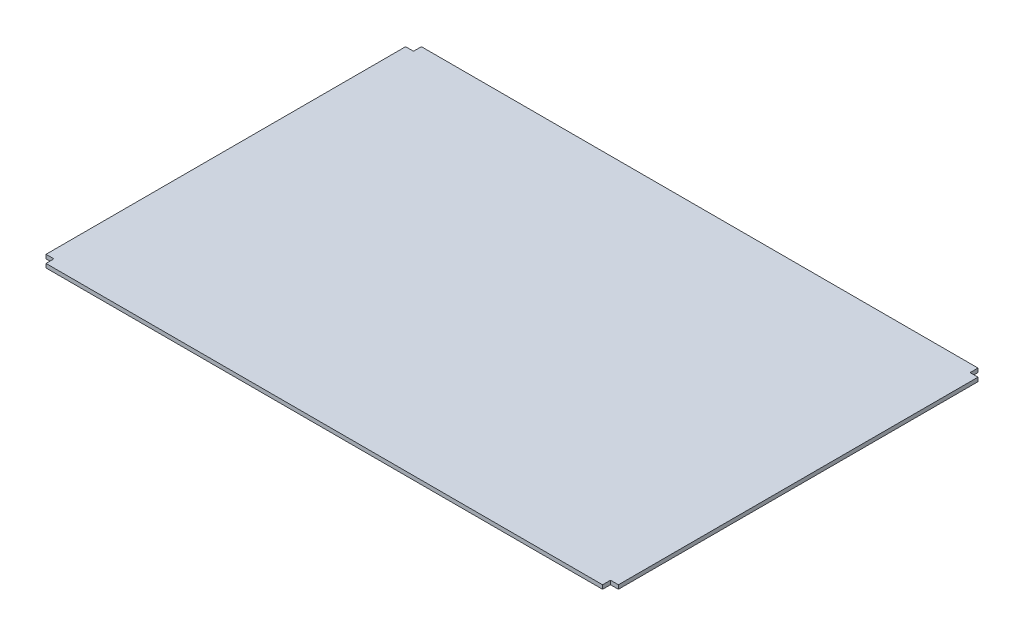
ISO-10303-21;
HEADER;
FILE_DESCRIPTION(('STEP AP214'),'2;1');
FILE_NAME('part.step','',(''),(''),'','','');
FILE_SCHEMA(('AUTOMOTIVE_DESIGN { 1 0 10303 214 1 1 1 1 }'));
ENDSEC;
DATA;
#1=APPLICATION_CONTEXT('core data for automotive mechanical design processes');
#2=APPLICATION_PROTOCOL_DEFINITION('international standard','automotive_design',2000,#1);
#3=PRODUCT_CONTEXT('',#1,'mechanical');
#4=PRODUCT('Part','Part','',(#3));
#5=PRODUCT_RELATED_PRODUCT_CATEGORY('part','',(#4));
#6=PRODUCT_DEFINITION_FORMATION('','',#4);
#7=PRODUCT_DEFINITION_CONTEXT('part definition',#1,'design');
#8=PRODUCT_DEFINITION('design','',#6,#7);
#9=PRODUCT_DEFINITION_SHAPE('','',#8);
#10=(LENGTH_UNIT() NAMED_UNIT(*) SI_UNIT(.MILLI.,.METRE.));
#11=(NAMED_UNIT(*) PLANE_ANGLE_UNIT() SI_UNIT($,.RADIAN.));
#12=(NAMED_UNIT(*) SI_UNIT($,.STERADIAN.) SOLID_ANGLE_UNIT());
#13=UNCERTAINTY_MEASURE_WITH_UNIT(LENGTH_MEASURE(1.E-05),#10,'distance_accuracy_value','');
#14=(GEOMETRIC_REPRESENTATION_CONTEXT(3) GLOBAL_UNCERTAINTY_ASSIGNED_CONTEXT((#13)) GLOBAL_UNIT_ASSIGNED_CONTEXT((#10,
#11,#12)) REPRESENTATION_CONTEXT('',''));
#15=CARTESIAN_POINT('',(0.,0.,0.));
#16=DIRECTION('',(0.,0.,1.));
#17=DIRECTION('',(1.,0.,0.));
#18=AXIS2_PLACEMENT_3D('',#15,#16,#17);
#19=CARTESIAN_POINT('',(1388.5,20.,910.));
#20=DIRECTION('',(-1.,0.,0.));
#21=DIRECTION('',(0.,0.,1.));
#22=AXIS2_PLACEMENT_3D('',#19,#20,#21);
#23=PLANE('',#22);
#24=DIRECTION('',(0.,0.,-1.));
#25=VECTOR('',#24,1.);
#26=CARTESIAN_POINT('',(1388.5,0.,910.));
#27=LINE('',#26,#25);
#28=CARTESIAN_POINT('',(1388.5,0.,910.));
#29=VERTEX_POINT('',#28);
#30=CARTESIAN_POINT('',(1388.5,0.,870.));
#31=VERTEX_POINT('',#30);
#32=EDGE_CURVE('E152',#29,#31,#27,.T.);
#33=ORIENTED_EDGE('',*,*,#32,.T.);
#34=DIRECTION('',(0.,-1.,0.));
#35=VECTOR('',#34,1.);
#36=CARTESIAN_POINT('',(1388.5,20.,870.));
#37=LINE('',#36,#35);
#38=CARTESIAN_POINT('',(1388.5,20.,870.));
#39=VERTEX_POINT('',#38);
#40=EDGE_CURVE('E11',#39,#31,#37,.T.);
#41=ORIENTED_EDGE('',*,*,#40,.F.);
#42=DIRECTION('',(0.,0.,-1.));
#43=VECTOR('',#42,1.);
#44=CARTESIAN_POINT('',(1388.5,20.,910.));
#45=LINE('',#44,#43);
#46=CARTESIAN_POINT('',(1388.5,20.,910.));
#47=VERTEX_POINT('',#46);
#48=EDGE_CURVE('E174',#47,#39,#45,.T.);
#49=ORIENTED_EDGE('',*,*,#48,.F.);
#50=DIRECTION('',(0.,-1.,0.));
#51=VECTOR('',#50,1.);
#52=CARTESIAN_POINT('',(1388.5,20.,910.));
#53=LINE('',#52,#51);
#54=EDGE_CURVE('E148',#47,#29,#53,.T.);
#55=ORIENTED_EDGE('',*,*,#54,.T.);
#56=EDGE_LOOP('',(#33,#41,#49,#55));
#57=FACE_BOUND('',#56,.T.);
#58=ADVANCED_FACE('F32',(#57),#23,.F.);
#59=CARTESIAN_POINT('',(1428.5,20.,870.));
#60=DIRECTION('',(0.,0.,-1.));
#61=DIRECTION('',(-1.,0.,0.));
#62=AXIS2_PLACEMENT_3D('',#59,#60,#61);
#63=PLANE('',#62);
#64=DIRECTION('',(1.,0.,0.));
#65=VECTOR('',#64,1.);
#66=CARTESIAN_POINT('',(1428.5,0.,870.));
#67=LINE('',#66,#65);
#68=CARTESIAN_POINT('',(1428.5,0.,870.));
#69=VERTEX_POINT('',#68);
#70=EDGE_CURVE('E155',#31,#69,#67,.T.);
#71=ORIENTED_EDGE('',*,*,#70,.T.);
#72=DIRECTION('',(0.,-1.,0.));
#73=VECTOR('',#72,1.);
#74=CARTESIAN_POINT('',(1428.5,20.,870.));
#75=LINE('',#74,#73);
#76=CARTESIAN_POINT('',(1428.5,20.,870.));
#77=VERTEX_POINT('',#76);
#78=EDGE_CURVE('E40',#77,#69,#75,.T.);
#79=ORIENTED_EDGE('',*,*,#78,.F.);
#80=DIRECTION('',(1.,0.,0.));
#81=VECTOR('',#80,1.);
#82=CARTESIAN_POINT('',(1428.5,20.,870.));
#83=LINE('',#82,#81);
#84=EDGE_CURVE('E103',#39,#77,#83,.T.);
#85=ORIENTED_EDGE('',*,*,#84,.F.);
#86=ORIENTED_EDGE('',*,*,#40,.T.);
#87=EDGE_LOOP('',(#71,#79,#85,#86));
#88=FACE_BOUND('',#87,.T.);
#89=ADVANCED_FACE('F252',(#88),#63,.F.);
#90=CARTESIAN_POINT('',(1428.5,20.,870.));
#91=DIRECTION('',(-1.,0.,0.));
#92=DIRECTION('',(0.,0.,1.));
#93=AXIS2_PLACEMENT_3D('',#90,#91,#92);
#94=PLANE('',#93);
#95=DIRECTION('',(0.,0.,-1.));
#96=VECTOR('',#95,1.);
#97=CARTESIAN_POINT('',(1428.5,0.,870.));
#98=LINE('',#97,#96);
#99=CARTESIAN_POINT('',(1428.5,0.,-950.));
#100=VERTEX_POINT('',#99);
#101=EDGE_CURVE('E157',#69,#100,#98,.T.);
#102=ORIENTED_EDGE('',*,*,#101,.T.);
#103=DIRECTION('',(0.,-1.,0.));
#104=VECTOR('',#103,1.);
#105=CARTESIAN_POINT('',(1428.5,20.,-950.));
#106=LINE('',#105,#104);
#107=CARTESIAN_POINT('',(1428.5,20.,-950.));
#108=VERTEX_POINT('',#107);
#109=EDGE_CURVE('E193',#108,#100,#106,.T.);
#110=ORIENTED_EDGE('',*,*,#109,.F.);
#111=DIRECTION('',(0.,0.,-1.));
#112=VECTOR('',#111,1.);
#113=CARTESIAN_POINT('',(1428.5,20.,870.));
#114=LINE('',#113,#112);
#115=EDGE_CURVE('E201',#77,#108,#114,.T.);
#116=ORIENTED_EDGE('',*,*,#115,.F.);
#117=ORIENTED_EDGE('',*,*,#78,.T.);
#118=EDGE_LOOP('',(#102,#110,#116,#117));
#119=FACE_BOUND('',#118,.T.);
#120=ADVANCED_FACE('F199',(#119),#94,.F.);
#121=CARTESIAN_POINT('',(1428.5,20.,-950.));
#122=DIRECTION('',(0.,0.,1.));
#123=DIRECTION('',(1.,0.,0.));
#124=AXIS2_PLACEMENT_3D('',#121,#122,#123);
#125=PLANE('',#124);
#126=DIRECTION('',(-1.,0.,0.));
#127=VECTOR('',#126,1.);
#128=CARTESIAN_POINT('',(1428.5,0.,-950.));
#129=LINE('',#128,#127);
#130=CARTESIAN_POINT('',(1388.5,0.,-950.));
#131=VERTEX_POINT('',#130);
#132=EDGE_CURVE('E159',#100,#131,#129,.T.);
#133=ORIENTED_EDGE('',*,*,#132,.T.);
#134=DIRECTION('',(0.,-1.,0.));
#135=VECTOR('',#134,1.);
#136=CARTESIAN_POINT('',(1388.5,20.,-950.));
#137=LINE('',#136,#135);
#138=CARTESIAN_POINT('',(1388.5,20.,-950.));
#139=VERTEX_POINT('',#138);
#140=EDGE_CURVE('E190',#139,#131,#137,.T.);
#141=ORIENTED_EDGE('',*,*,#140,.F.);
#142=DIRECTION('',(-1.,0.,0.));
#143=VECTOR('',#142,1.);
#144=CARTESIAN_POINT('',(1428.5,20.,-950.));
#145=LINE('',#144,#143);
#146=EDGE_CURVE('E219',#108,#139,#145,.T.);
#147=ORIENTED_EDGE('',*,*,#146,.F.);
#148=ORIENTED_EDGE('',*,*,#109,.T.);
#149=EDGE_LOOP('',(#133,#141,#147,#148));
#150=FACE_BOUND('',#149,.T.);
#151=ADVANCED_FACE('F210',(#150),#125,.F.);
#152=CARTESIAN_POINT('',(1388.5,20.,-989.999999999999));
#153=DIRECTION('',(-1.,0.,0.));
#154=DIRECTION('',(0.,0.,1.));
#155=AXIS2_PLACEMENT_3D('',#152,#153,#154);
#156=PLANE('',#155);
#157=DIRECTION('',(0.,0.,-1.));
#158=VECTOR('',#157,1.);
#159=CARTESIAN_POINT('',(1388.5,0.,-989.999999999999));
#160=LINE('',#159,#158);
#161=CARTESIAN_POINT('',(1388.5,0.,-989.999999999999));
#162=VERTEX_POINT('',#161);
#163=EDGE_CURVE('E161',#131,#162,#160,.T.);
#164=ORIENTED_EDGE('',*,*,#163,.T.);
#165=DIRECTION('',(0.,-1.,0.));
#166=VECTOR('',#165,1.);
#167=CARTESIAN_POINT('',(1388.5,20.,-989.999999999999));
#168=LINE('',#167,#166);
#169=CARTESIAN_POINT('',(1388.5,20.,-989.999999999999));
#170=VERTEX_POINT('',#169);
#171=EDGE_CURVE('E187',#170,#162,#168,.T.);
#172=ORIENTED_EDGE('',*,*,#171,.F.);
#173=DIRECTION('',(0.,0.,-1.));
#174=VECTOR('',#173,1.);
#175=CARTESIAN_POINT('',(1388.5,20.,-989.999999999999));
#176=LINE('',#175,#174);
#177=EDGE_CURVE('E216',#139,#170,#176,.T.);
#178=ORIENTED_EDGE('',*,*,#177,.F.);
#179=ORIENTED_EDGE('',*,*,#140,.T.);
#180=EDGE_LOOP('',(#164,#172,#178,#179));
#181=FACE_BOUND('',#180,.T.);
#182=ADVANCED_FACE('F214',(#181),#156,.F.);
#183=CARTESIAN_POINT('',(1388.5,20.,-989.999999999999));
#184=DIRECTION('',(0.,0.,1.));
#185=DIRECTION('',(1.,0.,0.));
#186=AXIS2_PLACEMENT_3D('',#183,#184,#185);
#187=PLANE('',#186);
#188=DIRECTION('',(-1.,0.,0.));
#189=VECTOR('',#188,1.);
#190=CARTESIAN_POINT('',(1388.5,0.,-989.999999999999));
#191=LINE('',#190,#189);
#192=CARTESIAN_POINT('',(-1428.5,0.,-989.999999999999));
#193=VERTEX_POINT('',#192);
#194=EDGE_CURVE('E163',#162,#193,#191,.T.);
#195=ORIENTED_EDGE('',*,*,#194,.T.);
#196=DIRECTION('',(0.,-1.,0.));
#197=VECTOR('',#196,1.);
#198=CARTESIAN_POINT('',(-1428.5,20.,-989.999999999999));
#199=LINE('',#198,#197);
#200=CARTESIAN_POINT('',(-1428.5,20.,-989.999999999999));
#201=VERTEX_POINT('',#200);
#202=EDGE_CURVE('E184',#201,#193,#199,.T.);
#203=ORIENTED_EDGE('',*,*,#202,.F.);
#204=DIRECTION('',(-1.,0.,0.));
#205=VECTOR('',#204,1.);
#206=CARTESIAN_POINT('',(1388.5,20.,-989.999999999999));
#207=LINE('',#206,#205);
#208=EDGE_CURVE('E218',#170,#201,#207,.T.);
#209=ORIENTED_EDGE('',*,*,#208,.F.);
#210=ORIENTED_EDGE('',*,*,#171,.T.);
#211=EDGE_LOOP('',(#195,#203,#209,#210));
#212=FACE_BOUND('',#211,.T.);
#213=ADVANCED_FACE('F265',(#212),#187,.F.);
#214=CARTESIAN_POINT('',(-1428.5,20.,-989.999999999999));
#215=DIRECTION('',(1.,0.,0.));
#216=DIRECTION('',(0.,0.,-1.));
#217=AXIS2_PLACEMENT_3D('',#214,#215,#216);
#218=PLANE('',#217);
#219=DIRECTION('',(0.,0.,1.));
#220=VECTOR('',#219,1.);
#221=CARTESIAN_POINT('',(-1428.5,0.,-989.999999999999));
#222=LINE('',#221,#220);
#223=CARTESIAN_POINT('',(-1428.5,0.,-949.999999999999));
#224=VERTEX_POINT('',#223);
#225=EDGE_CURVE('E165',#193,#224,#222,.T.);
#226=ORIENTED_EDGE('',*,*,#225,.T.);
#227=DIRECTION('',(0.,-1.,0.));
#228=VECTOR('',#227,1.);
#229=CARTESIAN_POINT('',(-1428.5,20.,-949.999999999999));
#230=LINE('',#229,#228);
#231=CARTESIAN_POINT('',(-1428.5,20.,-949.999999999999));
#232=VERTEX_POINT('',#231);
#233=EDGE_CURVE('E181',#232,#224,#230,.T.);
#234=ORIENTED_EDGE('',*,*,#233,.F.);
#235=DIRECTION('',(0.,0.,1.));
#236=VECTOR('',#235,1.);
#237=CARTESIAN_POINT('',(-1428.5,20.,-989.999999999999));
#238=LINE('',#237,#236);
#239=EDGE_CURVE('E221',#201,#232,#238,.T.);
#240=ORIENTED_EDGE('',*,*,#239,.F.);
#241=ORIENTED_EDGE('',*,*,#202,.T.);
#242=EDGE_LOOP('',(#226,#234,#240,#241));
#243=FACE_BOUND('',#242,.T.);
#244=ADVANCED_FACE('F268',(#243),#218,.F.);
#245=CARTESIAN_POINT('',(-1468.5,20.,-949.999999999999));
#246=DIRECTION('',(0.,0.,1.));
#247=DIRECTION('',(1.,0.,0.));
#248=AXIS2_PLACEMENT_3D('',#245,#246,#247);
#249=PLANE('',#248);
#250=DIRECTION('',(-1.,0.,0.));
#251=VECTOR('',#250,1.);
#252=CARTESIAN_POINT('',(-1468.5,0.,-949.999999999999));
#253=LINE('',#252,#251);
#254=CARTESIAN_POINT('',(-1468.5,0.,-949.999999999999));
#255=VERTEX_POINT('',#254);
#256=EDGE_CURVE('E167',#224,#255,#253,.T.);
#257=ORIENTED_EDGE('',*,*,#256,.T.);
#258=DIRECTION('',(0.,-1.,0.));
#259=VECTOR('',#258,1.);
#260=CARTESIAN_POINT('',(-1468.5,20.,-949.999999999999));
#261=LINE('',#260,#259);
#262=CARTESIAN_POINT('',(-1468.5,20.,-949.999999999999));
#263=VERTEX_POINT('',#262);
#264=EDGE_CURVE('E178',#263,#255,#261,.T.);
#265=ORIENTED_EDGE('',*,*,#264,.F.);
#266=DIRECTION('',(-1.,0.,0.));
#267=VECTOR('',#266,1.);
#268=CARTESIAN_POINT('',(-1468.5,20.,-949.999999999999));
#269=LINE('',#268,#267);
#270=EDGE_CURVE('E227',#232,#263,#269,.T.);
#271=ORIENTED_EDGE('',*,*,#270,.F.);
#272=ORIENTED_EDGE('',*,*,#233,.T.);
#273=EDGE_LOOP('',(#257,#265,#271,#272));
#274=FACE_BOUND('',#273,.T.);
#275=ADVANCED_FACE('F233',(#274),#249,.F.);
#276=CARTESIAN_POINT('',(-1468.5,20.,870.000000000001));
#277=DIRECTION('',(1.,0.,0.));
#278=DIRECTION('',(0.,0.,-1.));
#279=AXIS2_PLACEMENT_3D('',#276,#277,#278);
#280=PLANE('',#279);
#281=DIRECTION('',(0.,0.,1.));
#282=VECTOR('',#281,1.);
#283=CARTESIAN_POINT('',(-1468.5,0.,870.000000000001));
#284=LINE('',#283,#282);
#285=CARTESIAN_POINT('',(-1468.5,0.,870.000000000001));
#286=VERTEX_POINT('',#285);
#287=EDGE_CURVE('E169',#255,#286,#284,.T.);
#288=ORIENTED_EDGE('',*,*,#287,.T.);
#289=DIRECTION('',(0.,-1.,0.));
#290=VECTOR('',#289,1.);
#291=CARTESIAN_POINT('',(-1468.5,20.,870.000000000001));
#292=LINE('',#291,#290);
#293=CARTESIAN_POINT('',(-1468.5,20.,870.000000000001));
#294=VERTEX_POINT('',#293);
#295=EDGE_CURVE('E143',#294,#286,#292,.T.);
#296=ORIENTED_EDGE('',*,*,#295,.F.);
#297=DIRECTION('',(0.,0.,1.));
#298=VECTOR('',#297,1.);
#299=CARTESIAN_POINT('',(-1468.5,20.,870.000000000001));
#300=LINE('',#299,#298);
#301=EDGE_CURVE('E134',#263,#294,#300,.T.);
#302=ORIENTED_EDGE('',*,*,#301,.F.);
#303=ORIENTED_EDGE('',*,*,#264,.T.);
#304=EDGE_LOOP('',(#288,#296,#302,#303));
#305=FACE_BOUND('',#304,.T.);
#306=ADVANCED_FACE('F237',(#305),#280,.F.);
#307=CARTESIAN_POINT('',(-1468.5,20.,870.000000000001));
#308=DIRECTION('',(0.,0.,-1.));
#309=DIRECTION('',(-1.,0.,0.));
#310=AXIS2_PLACEMENT_3D('',#307,#308,#309);
#311=PLANE('',#310);
#312=DIRECTION('',(1.,0.,0.));
#313=VECTOR('',#312,1.);
#314=CARTESIAN_POINT('',(-1468.5,0.,870.000000000001));
#315=LINE('',#314,#313);
#316=CARTESIAN_POINT('',(-1428.5,0.,870.000000000001));
#317=VERTEX_POINT('',#316);
#318=EDGE_CURVE('E142',#286,#317,#315,.T.);
#319=ORIENTED_EDGE('',*,*,#318,.T.);
#320=DIRECTION('',(0.,-1.,0.));
#321=VECTOR('',#320,1.);
#322=CARTESIAN_POINT('',(-1428.5,20.,870.000000000001));
#323=LINE('',#322,#321);
#324=CARTESIAN_POINT('',(-1428.5,20.,870.000000000001));
#325=VERTEX_POINT('',#324);
#326=EDGE_CURVE('E139',#325,#317,#323,.T.);
#327=ORIENTED_EDGE('',*,*,#326,.F.);
#328=DIRECTION('',(1.,0.,0.));
#329=VECTOR('',#328,1.);
#330=CARTESIAN_POINT('',(-1468.5,20.,870.000000000001));
#331=LINE('',#330,#329);
#332=EDGE_CURVE('E128',#294,#325,#331,.T.);
#333=ORIENTED_EDGE('',*,*,#332,.F.);
#334=ORIENTED_EDGE('',*,*,#295,.T.);
#335=EDGE_LOOP('',(#319,#327,#333,#334));
#336=FACE_BOUND('',#335,.T.);
#337=ADVANCED_FACE('F140',(#336),#311,.F.);
#338=CARTESIAN_POINT('',(-1428.5,20.,910.));
#339=DIRECTION('',(1.,0.,0.));
#340=DIRECTION('',(0.,0.,-1.));
#341=AXIS2_PLACEMENT_3D('',#338,#339,#340);
#342=PLANE('',#341);
#343=DIRECTION('',(0.,0.,1.));
#344=VECTOR('',#343,1.);
#345=CARTESIAN_POINT('',(-1428.5,0.,910.));
#346=LINE('',#345,#344);
#347=CARTESIAN_POINT('',(-1428.5,0.,910.));
#348=VERTEX_POINT('',#347);
#349=EDGE_CURVE('E89',#317,#348,#346,.T.);
#350=ORIENTED_EDGE('',*,*,#349,.T.);
#351=DIRECTION('',(0.,-1.,0.));
#352=VECTOR('',#351,1.);
#353=CARTESIAN_POINT('',(-1428.5,20.,910.));
#354=LINE('',#353,#352);
#355=CARTESIAN_POINT('',(-1428.5,20.,910.));
#356=VERTEX_POINT('',#355);
#357=EDGE_CURVE('E144',#356,#348,#354,.T.);
#358=ORIENTED_EDGE('',*,*,#357,.F.);
#359=DIRECTION('',(0.,0.,1.));
#360=VECTOR('',#359,1.);
#361=CARTESIAN_POINT('',(-1428.5,20.,910.));
#362=LINE('',#361,#360);
#363=EDGE_CURVE('E132',#325,#356,#362,.T.);
#364=ORIENTED_EDGE('',*,*,#363,.F.);
#365=ORIENTED_EDGE('',*,*,#326,.T.);
#366=EDGE_LOOP('',(#350,#358,#364,#365));
#367=FACE_BOUND('',#366,.T.);
#368=ADVANCED_FACE('F146',(#367),#342,.F.);
#369=CARTESIAN_POINT('',(1388.5,20.,910.));
#370=DIRECTION('',(0.,0.,-1.));
#371=DIRECTION('',(-1.,0.,0.));
#372=AXIS2_PLACEMENT_3D('',#369,#370,#371);
#373=PLANE('',#372);
#374=DIRECTION('',(1.,0.,0.));
#375=VECTOR('',#374,1.);
#376=CARTESIAN_POINT('',(1388.5,0.,910.));
#377=LINE('',#376,#375);
#378=EDGE_CURVE('E95',#348,#29,#377,.T.);
#379=ORIENTED_EDGE('',*,*,#378,.T.);
#380=ORIENTED_EDGE('',*,*,#54,.F.);
#381=DIRECTION('',(1.,0.,0.));
#382=VECTOR('',#381,1.);
#383=CARTESIAN_POINT('',(1388.5,20.,910.));
#384=LINE('',#383,#382);
#385=EDGE_CURVE('E48',#356,#47,#384,.T.);
#386=ORIENTED_EDGE('',*,*,#385,.F.);
#387=ORIENTED_EDGE('',*,*,#357,.T.);
#388=EDGE_LOOP('',(#379,#380,#386,#387));
#389=FACE_BOUND('',#388,.T.);
#390=ADVANCED_FACE('F241',(#389),#373,.F.);
#391=CARTESIAN_POINT('',(0.,20.,0.));
#392=DIRECTION('',(0.,1.,0.));
#393=DIRECTION('',(0.,0.,1.));
#394=AXIS2_PLACEMENT_3D('',#391,#392,#393);
#395=PLANE('',#394);
#396=ORIENTED_EDGE('',*,*,#48,.T.);
#397=ORIENTED_EDGE('',*,*,#84,.T.);
#398=ORIENTED_EDGE('',*,*,#115,.T.);
#399=ORIENTED_EDGE('',*,*,#146,.T.);
#400=ORIENTED_EDGE('',*,*,#177,.T.);
#401=ORIENTED_EDGE('',*,*,#208,.T.);
#402=ORIENTED_EDGE('',*,*,#239,.T.);
#403=ORIENTED_EDGE('',*,*,#270,.T.);
#404=ORIENTED_EDGE('',*,*,#301,.T.);
#405=ORIENTED_EDGE('',*,*,#332,.T.);
#406=ORIENTED_EDGE('',*,*,#363,.T.);
#407=ORIENTED_EDGE('',*,*,#385,.T.);
#408=EDGE_LOOP('',(#396,#397,#398,#399,#400,#401,#402,#403,#404,#405,#406,#407));
#409=FACE_BOUND('',#408,.T.);
#410=ADVANCED_FACE('F130',(#409),#395,.T.);
#411=CARTESIAN_POINT('',(0.,0.,0.));
#412=DIRECTION('',(0.,1.,0.));
#413=DIRECTION('',(0.,0.,1.));
#414=AXIS2_PLACEMENT_3D('',#411,#412,#413);
#415=PLANE('',#414);
#416=ORIENTED_EDGE('',*,*,#32,.F.);
#417=ORIENTED_EDGE('',*,*,#378,.F.);
#418=ORIENTED_EDGE('',*,*,#349,.F.);
#419=ORIENTED_EDGE('',*,*,#318,.F.);
#420=ORIENTED_EDGE('',*,*,#287,.F.);
#421=ORIENTED_EDGE('',*,*,#256,.F.);
#422=ORIENTED_EDGE('',*,*,#225,.F.);
#423=ORIENTED_EDGE('',*,*,#194,.F.);
#424=ORIENTED_EDGE('',*,*,#163,.F.);
#425=ORIENTED_EDGE('',*,*,#132,.F.);
#426=ORIENTED_EDGE('',*,*,#101,.F.);
#427=ORIENTED_EDGE('',*,*,#70,.F.);
#428=EDGE_LOOP('',(#416,#417,#418,#419,#420,#421,#422,#423,#424,#425,#426,#427));
#429=FACE_BOUND('',#428,.T.);
#430=ADVANCED_FACE('F205',(#429),#415,.F.);
#431=CLOSED_SHELL('',(#58,#89,#120,#151,#182,#213,#244,#275,#306,#337,#368,#390,#410,#430));
#432=MANIFOLD_SOLID_BREP('B2',#431);
#433=ADVANCED_BREP_SHAPE_REPRESENTATION('',(#18,#432),#14);
#434=SHAPE_DEFINITION_REPRESENTATION(#9,#433);
ENDSEC;
END-ISO-10303-21;
